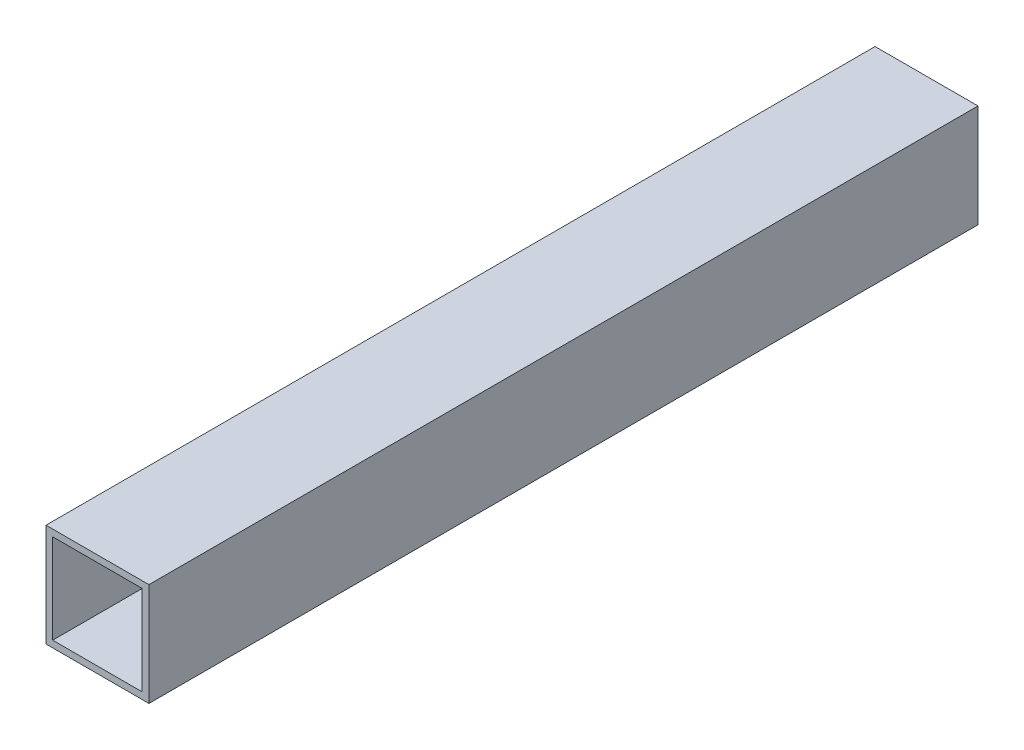
ISO-10303-21;
HEADER;
FILE_DESCRIPTION(('STEP AP214'),'2;1');
FILE_NAME('part.step','',(''),(''),'','','');
FILE_SCHEMA(('AUTOMOTIVE_DESIGN { 1 0 10303 214 1 1 1 1 }'));
ENDSEC;
DATA;
#1=APPLICATION_CONTEXT('core data for automotive mechanical design processes');
#2=APPLICATION_PROTOCOL_DEFINITION('international standard','automotive_design',2000,#1);
#3=PRODUCT_CONTEXT('',#1,'mechanical');
#4=PRODUCT('Part','Part','',(#3));
#5=PRODUCT_RELATED_PRODUCT_CATEGORY('part','',(#4));
#6=PRODUCT_DEFINITION_FORMATION('','',#4);
#7=PRODUCT_DEFINITION_CONTEXT('part definition',#1,'design');
#8=PRODUCT_DEFINITION('design','',#6,#7);
#9=PRODUCT_DEFINITION_SHAPE('','',#8);
#10=(LENGTH_UNIT() NAMED_UNIT(*) SI_UNIT(.MILLI.,.METRE.));
#11=(NAMED_UNIT(*) PLANE_ANGLE_UNIT() SI_UNIT($,.RADIAN.));
#12=(NAMED_UNIT(*) SI_UNIT($,.STERADIAN.) SOLID_ANGLE_UNIT());
#13=UNCERTAINTY_MEASURE_WITH_UNIT(LENGTH_MEASURE(1.E-05),#10,'distance_accuracy_value','');
#14=(GEOMETRIC_REPRESENTATION_CONTEXT(3) GLOBAL_UNCERTAINTY_ASSIGNED_CONTEXT((#13)) GLOBAL_UNIT_ASSIGNED_CONTEXT((#10,
#11,#12)) REPRESENTATION_CONTEXT('',''));
#15=CARTESIAN_POINT('',(0.,0.,0.));
#16=DIRECTION('',(0.,0.,1.));
#17=DIRECTION('',(1.,0.,0.));
#18=AXIS2_PLACEMENT_3D('',#15,#16,#17);
#19=CARTESIAN_POINT('',(0.,0.,204.6));
#20=DIRECTION('',(0.,0.,-1.));
#21=DIRECTION('',(-1.,0.,0.));
#22=AXIS2_PLACEMENT_3D('',#19,#20,#21);
#23=PLANE('',#22);
#24=DIRECTION('',(0.,-1.,0.));
#25=VECTOR('',#24,1.);
#26=CARTESIAN_POINT('',(-12.7,12.7,204.6));
#27=LINE('',#26,#25);
#28=CARTESIAN_POINT('',(-12.7,12.7,204.6));
#29=VERTEX_POINT('',#28);
#30=CARTESIAN_POINT('',(-12.7,-12.7,204.6));
#31=VERTEX_POINT('',#30);
#32=EDGE_CURVE('E134',#29,#31,#27,.T.);
#33=ORIENTED_EDGE('',*,*,#32,.T.);
#34=DIRECTION('',(1.,0.,0.));
#35=VECTOR('',#34,1.);
#36=CARTESIAN_POINT('',(12.7,-12.7,204.6));
#37=LINE('',#36,#35);
#38=CARTESIAN_POINT('',(12.7,-12.7,204.6));
#39=VERTEX_POINT('',#38);
#40=EDGE_CURVE('E137',#31,#39,#37,.T.);
#41=ORIENTED_EDGE('',*,*,#40,.T.);
#42=DIRECTION('',(0.,1.,0.));
#43=VECTOR('',#42,1.);
#44=CARTESIAN_POINT('',(12.7,12.7,204.6));
#45=LINE('',#44,#43);
#46=CARTESIAN_POINT('',(12.7,12.7,204.6));
#47=VERTEX_POINT('',#46);
#48=EDGE_CURVE('E140',#39,#47,#45,.T.);
#49=ORIENTED_EDGE('',*,*,#48,.T.);
#50=DIRECTION('',(-1.,0.,0.));
#51=VECTOR('',#50,1.);
#52=CARTESIAN_POINT('',(12.7,12.7,204.6));
#53=LINE('',#52,#51);
#54=EDGE_CURVE('E142',#47,#29,#53,.T.);
#55=ORIENTED_EDGE('',*,*,#54,.T.);
#56=EDGE_LOOP('',(#33,#41,#49,#55));
#57=FACE_BOUND('',#56,.T.);
#58=DIRECTION('',(0.,-1.,0.));
#59=VECTOR('',#58,1.);
#60=CARTESIAN_POINT('',(-11.049,11.049,204.6));
#61=LINE('',#60,#59);
#62=CARTESIAN_POINT('',(-11.049,11.049,204.6));
#63=VERTEX_POINT('',#62);
#64=CARTESIAN_POINT('',(-11.049,-11.049,204.6));
#65=VERTEX_POINT('',#64);
#66=EDGE_CURVE('E98',#63,#65,#61,.T.);
#67=ORIENTED_EDGE('',*,*,#66,.F.);
#68=DIRECTION('',(-1.,0.,0.));
#69=VECTOR('',#68,1.);
#70=CARTESIAN_POINT('',(11.049,11.049,204.6));
#71=LINE('',#70,#69);
#72=CARTESIAN_POINT('',(11.049,11.049,204.6));
#73=VERTEX_POINT('',#72);
#74=EDGE_CURVE('E120',#73,#63,#71,.T.);
#75=ORIENTED_EDGE('',*,*,#74,.F.);
#76=DIRECTION('',(0.,1.,0.));
#77=VECTOR('',#76,1.);
#78=CARTESIAN_POINT('',(11.049,11.049,204.6));
#79=LINE('',#78,#77);
#80=CARTESIAN_POINT('',(11.049,-11.049,204.6));
#81=VERTEX_POINT('',#80);
#82=EDGE_CURVE('E118',#81,#73,#79,.T.);
#83=ORIENTED_EDGE('',*,*,#82,.F.);
#84=DIRECTION('',(1.,0.,0.));
#85=VECTOR('',#84,1.);
#86=CARTESIAN_POINT('',(11.049,-11.049,204.6));
#87=LINE('',#86,#85);
#88=EDGE_CURVE('E106',#65,#81,#87,.T.);
#89=ORIENTED_EDGE('',*,*,#88,.F.);
#90=EDGE_LOOP('',(#67,#75,#83,#89));
#91=FACE_BOUND('',#90,.T.);
#92=ADVANCED_FACE('F33',(#57,#91),#23,.F.);
#93=CARTESIAN_POINT('',(0.,0.,0.));
#94=DIRECTION('',(0.,0.,-1.));
#95=DIRECTION('',(-1.,0.,0.));
#96=AXIS2_PLACEMENT_3D('',#93,#94,#95);
#97=PLANE('',#96);
#98=DIRECTION('',(0.,-1.,0.));
#99=VECTOR('',#98,1.);
#100=CARTESIAN_POINT('',(-12.7,12.7,0.));
#101=LINE('',#100,#99);
#102=CARTESIAN_POINT('',(-12.7,12.7,0.));
#103=VERTEX_POINT('',#102);
#104=CARTESIAN_POINT('',(-12.7,-12.7,0.));
#105=VERTEX_POINT('',#104);
#106=EDGE_CURVE('E114',#103,#105,#101,.T.);
#107=ORIENTED_EDGE('',*,*,#106,.F.);
#108=DIRECTION('',(-1.,0.,0.));
#109=VECTOR('',#108,1.);
#110=CARTESIAN_POINT('',(12.7,12.7,0.));
#111=LINE('',#110,#109);
#112=CARTESIAN_POINT('',(12.7,12.7,0.));
#113=VERTEX_POINT('',#112);
#114=EDGE_CURVE('E138',#113,#103,#111,.T.);
#115=ORIENTED_EDGE('',*,*,#114,.F.);
#116=DIRECTION('',(0.,1.,0.));
#117=VECTOR('',#116,1.);
#118=CARTESIAN_POINT('',(12.7,12.7,0.));
#119=LINE('',#118,#117);
#120=CARTESIAN_POINT('',(12.7,-12.7,0.));
#121=VERTEX_POINT('',#120);
#122=EDGE_CURVE('E149',#121,#113,#119,.T.);
#123=ORIENTED_EDGE('',*,*,#122,.F.);
#124=DIRECTION('',(1.,0.,0.));
#125=VECTOR('',#124,1.);
#126=CARTESIAN_POINT('',(12.7,-12.7,0.));
#127=LINE('',#126,#125);
#128=EDGE_CURVE('E147',#105,#121,#127,.T.);
#129=ORIENTED_EDGE('',*,*,#128,.F.);
#130=EDGE_LOOP('',(#107,#115,#123,#129));
#131=FACE_BOUND('',#130,.T.);
#132=DIRECTION('',(-1.,0.,0.));
#133=VECTOR('',#132,1.);
#134=CARTESIAN_POINT('',(11.049,11.049,0.));
#135=LINE('',#134,#133);
#136=CARTESIAN_POINT('',(11.049,11.049,0.));
#137=VERTEX_POINT('',#136);
#138=CARTESIAN_POINT('',(-11.049,11.049,0.));
#139=VERTEX_POINT('',#138);
#140=EDGE_CURVE('E107',#137,#139,#135,.T.);
#141=ORIENTED_EDGE('',*,*,#140,.T.);
#142=DIRECTION('',(0.,-1.,0.));
#143=VECTOR('',#142,1.);
#144=CARTESIAN_POINT('',(-11.049,11.049,0.));
#145=LINE('',#144,#143);
#146=CARTESIAN_POINT('',(-11.049,-11.049,0.));
#147=VERTEX_POINT('',#146);
#148=EDGE_CURVE('E56',#139,#147,#145,.T.);
#149=ORIENTED_EDGE('',*,*,#148,.T.);
#150=DIRECTION('',(1.,0.,0.));
#151=VECTOR('',#150,1.);
#152=CARTESIAN_POINT('',(11.049,-11.049,0.));
#153=LINE('',#152,#151);
#154=CARTESIAN_POINT('',(11.049,-11.049,0.));
#155=VERTEX_POINT('',#154);
#156=EDGE_CURVE('E113',#147,#155,#153,.T.);
#157=ORIENTED_EDGE('',*,*,#156,.T.);
#158=DIRECTION('',(0.,1.,0.));
#159=VECTOR('',#158,1.);
#160=CARTESIAN_POINT('',(11.049,11.049,0.));
#161=LINE('',#160,#159);
#162=EDGE_CURVE('E126',#155,#137,#161,.T.);
#163=ORIENTED_EDGE('',*,*,#162,.T.);
#164=EDGE_LOOP('',(#141,#149,#157,#163));
#165=FACE_BOUND('',#164,.T.);
#166=ADVANCED_FACE('F167',(#131,#165),#97,.T.);
#167=CARTESIAN_POINT('',(-12.7,12.7,204.6));
#168=DIRECTION('',(1.,0.,0.));
#169=DIRECTION('',(0.,0.,-1.));
#170=AXIS2_PLACEMENT_3D('',#167,#168,#169);
#171=PLANE('',#170);
#172=ORIENTED_EDGE('',*,*,#106,.T.);
#173=DIRECTION('',(0.,0.,-1.));
#174=VECTOR('',#173,1.);
#175=CARTESIAN_POINT('',(-12.7,-12.7,204.6));
#176=LINE('',#175,#174);
#177=EDGE_CURVE('E11',#31,#105,#176,.T.);
#178=ORIENTED_EDGE('',*,*,#177,.F.);
#179=ORIENTED_EDGE('',*,*,#32,.F.);
#180=DIRECTION('',(0.,0.,-1.));
#181=VECTOR('',#180,1.);
#182=CARTESIAN_POINT('',(-12.7,12.7,204.6));
#183=LINE('',#182,#181);
#184=EDGE_CURVE('E144',#29,#103,#183,.T.);
#185=ORIENTED_EDGE('',*,*,#184,.T.);
#186=EDGE_LOOP('',(#172,#178,#179,#185));
#187=FACE_BOUND('',#186,.T.);
#188=ADVANCED_FACE('F35',(#187),#171,.F.);
#189=CARTESIAN_POINT('',(12.7,-12.7,204.6));
#190=DIRECTION('',(0.,1.,0.));
#191=DIRECTION('',(-1.,0.,0.));
#192=AXIS2_PLACEMENT_3D('',#189,#190,#191);
#193=PLANE('',#192);
#194=ORIENTED_EDGE('',*,*,#128,.T.);
#195=DIRECTION('',(0.,0.,-1.));
#196=VECTOR('',#195,1.);
#197=CARTESIAN_POINT('',(12.7,-12.7,204.6));
#198=LINE('',#197,#196);
#199=EDGE_CURVE('E41',#39,#121,#198,.T.);
#200=ORIENTED_EDGE('',*,*,#199,.F.);
#201=ORIENTED_EDGE('',*,*,#40,.F.);
#202=ORIENTED_EDGE('',*,*,#177,.T.);
#203=EDGE_LOOP('',(#194,#200,#201,#202));
#204=FACE_BOUND('',#203,.T.);
#205=ADVANCED_FACE('F177',(#204),#193,.F.);
#206=CARTESIAN_POINT('',(12.7,12.7,204.6));
#207=DIRECTION('',(-1.,0.,0.));
#208=DIRECTION('',(0.,-1.,0.));
#209=AXIS2_PLACEMENT_3D('',#206,#207,#208);
#210=PLANE('',#209);
#211=ORIENTED_EDGE('',*,*,#122,.T.);
#212=DIRECTION('',(0.,0.,-1.));
#213=VECTOR('',#212,1.);
#214=CARTESIAN_POINT('',(12.7,12.7,204.6));
#215=LINE('',#214,#213);
#216=EDGE_CURVE('E154',#47,#113,#215,.T.);
#217=ORIENTED_EDGE('',*,*,#216,.F.);
#218=ORIENTED_EDGE('',*,*,#48,.F.);
#219=ORIENTED_EDGE('',*,*,#199,.T.);
#220=EDGE_LOOP('',(#211,#217,#218,#219));
#221=FACE_BOUND('',#220,.T.);
#222=ADVANCED_FACE('F161',(#221),#210,.F.);
#223=CARTESIAN_POINT('',(12.7,12.7,204.6));
#224=DIRECTION('',(0.,-1.,0.));
#225=DIRECTION('',(1.,0.,0.));
#226=AXIS2_PLACEMENT_3D('',#223,#224,#225);
#227=PLANE('',#226);
#228=ORIENTED_EDGE('',*,*,#114,.T.);
#229=ORIENTED_EDGE('',*,*,#184,.F.);
#230=ORIENTED_EDGE('',*,*,#54,.F.);
#231=ORIENTED_EDGE('',*,*,#216,.T.);
#232=EDGE_LOOP('',(#228,#229,#230,#231));
#233=FACE_BOUND('',#232,.T.);
#234=ADVANCED_FACE('F171',(#233),#227,.F.);
#235=CARTESIAN_POINT('',(-11.049,11.049,204.6));
#236=DIRECTION('',(1.,0.,0.));
#237=DIRECTION('',(0.,1.,0.));
#238=AXIS2_PLACEMENT_3D('',#235,#236,#237);
#239=PLANE('',#238);
#240=ORIENTED_EDGE('',*,*,#148,.F.);
#241=DIRECTION('',(0.,0.,-1.));
#242=VECTOR('',#241,1.);
#243=CARTESIAN_POINT('',(-11.049,11.049,204.6));
#244=LINE('',#243,#242);
#245=EDGE_CURVE('E102',#63,#139,#244,.T.);
#246=ORIENTED_EDGE('',*,*,#245,.F.);
#247=ORIENTED_EDGE('',*,*,#66,.T.);
#248=DIRECTION('',(0.,0.,-1.));
#249=VECTOR('',#248,1.);
#250=CARTESIAN_POINT('',(-11.049,-11.049,204.6));
#251=LINE('',#250,#249);
#252=EDGE_CURVE('E101',#65,#147,#251,.T.);
#253=ORIENTED_EDGE('',*,*,#252,.T.);
#254=EDGE_LOOP('',(#240,#246,#247,#253));
#255=FACE_BOUND('',#254,.T.);
#256=ADVANCED_FACE('F100',(#255),#239,.T.);
#257=CARTESIAN_POINT('',(11.049,-11.049,204.6));
#258=DIRECTION('',(0.,1.,0.));
#259=DIRECTION('',(-1.,0.,0.));
#260=AXIS2_PLACEMENT_3D('',#257,#258,#259);
#261=PLANE('',#260);
#262=ORIENTED_EDGE('',*,*,#156,.F.);
#263=ORIENTED_EDGE('',*,*,#252,.F.);
#264=ORIENTED_EDGE('',*,*,#88,.T.);
#265=DIRECTION('',(0.,0.,-1.));
#266=VECTOR('',#265,1.);
#267=CARTESIAN_POINT('',(11.049,-11.049,204.6));
#268=LINE('',#267,#266);
#269=EDGE_CURVE('E115',#81,#155,#268,.T.);
#270=ORIENTED_EDGE('',*,*,#269,.T.);
#271=EDGE_LOOP('',(#262,#263,#264,#270));
#272=FACE_BOUND('',#271,.T.);
#273=ADVANCED_FACE('F110',(#272),#261,.T.);
#274=CARTESIAN_POINT('',(11.049,11.049,204.6));
#275=DIRECTION('',(-1.,0.,0.));
#276=DIRECTION('',(0.,-1.,0.));
#277=AXIS2_PLACEMENT_3D('',#274,#275,#276);
#278=PLANE('',#277);
#279=ORIENTED_EDGE('',*,*,#162,.F.);
#280=ORIENTED_EDGE('',*,*,#269,.F.);
#281=ORIENTED_EDGE('',*,*,#82,.T.);
#282=DIRECTION('',(0.,0.,-1.));
#283=VECTOR('',#282,1.);
#284=CARTESIAN_POINT('',(11.049,11.049,204.6));
#285=LINE('',#284,#283);
#286=EDGE_CURVE('E48',#73,#137,#285,.T.);
#287=ORIENTED_EDGE('',*,*,#286,.T.);
#288=EDGE_LOOP('',(#279,#280,#281,#287));
#289=FACE_BOUND('',#288,.T.);
#290=ADVANCED_FACE('F200',(#289),#278,.T.);
#291=CARTESIAN_POINT('',(11.049,11.049,204.6));
#292=DIRECTION('',(0.,-1.,0.));
#293=DIRECTION('',(1.,0.,0.));
#294=AXIS2_PLACEMENT_3D('',#291,#292,#293);
#295=PLANE('',#294);
#296=ORIENTED_EDGE('',*,*,#140,.F.);
#297=ORIENTED_EDGE('',*,*,#286,.F.);
#298=ORIENTED_EDGE('',*,*,#74,.T.);
#299=ORIENTED_EDGE('',*,*,#245,.T.);
#300=EDGE_LOOP('',(#296,#297,#298,#299));
#301=FACE_BOUND('',#300,.T.);
#302=ADVANCED_FACE('F204',(#301),#295,.T.);
#303=CLOSED_SHELL('',(#92,#166,#188,#205,#222,#234,#256,#273,#290,#302));
#304=MANIFOLD_SOLID_BREP('B2',#303);
#305=ADVANCED_BREP_SHAPE_REPRESENTATION('',(#18,#304),#14);
#306=SHAPE_DEFINITION_REPRESENTATION(#9,#305);
ENDSEC;
END-ISO-10303-21;
